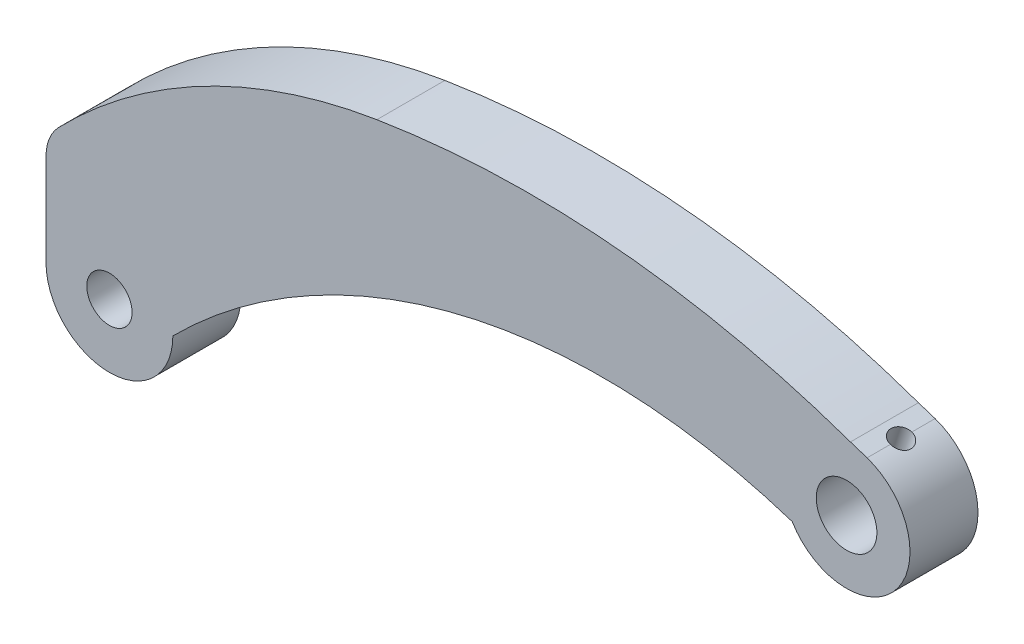
ISO-10303-21;
HEADER;
FILE_DESCRIPTION(('STEP AP214'),'2;1');
FILE_NAME('part.step','',(''),(''),'','','');
FILE_SCHEMA(('AUTOMOTIVE_DESIGN { 1 0 10303 214 1 1 1 1 }'));
ENDSEC;
DATA;
#1=APPLICATION_CONTEXT('core data for automotive mechanical design processes');
#2=APPLICATION_PROTOCOL_DEFINITION('international standard','automotive_design',2000,#1);
#3=PRODUCT_CONTEXT('',#1,'mechanical');
#4=PRODUCT('Part','Part','',(#3));
#5=PRODUCT_RELATED_PRODUCT_CATEGORY('part','',(#4));
#6=PRODUCT_DEFINITION_FORMATION('','',#4);
#7=PRODUCT_DEFINITION_CONTEXT('part definition',#1,'design');
#8=PRODUCT_DEFINITION('design','',#6,#7);
#9=PRODUCT_DEFINITION_SHAPE('','',#8);
#10=(LENGTH_UNIT() NAMED_UNIT(*) SI_UNIT(.MILLI.,.METRE.));
#11=(NAMED_UNIT(*) PLANE_ANGLE_UNIT() SI_UNIT($,.RADIAN.));
#12=(NAMED_UNIT(*) SI_UNIT($,.STERADIAN.) SOLID_ANGLE_UNIT());
#13=UNCERTAINTY_MEASURE_WITH_UNIT(LENGTH_MEASURE(1.E-05),#10,'distance_accuracy_value','');
#14=(GEOMETRIC_REPRESENTATION_CONTEXT(3) GLOBAL_UNCERTAINTY_ASSIGNED_CONTEXT((#13)) GLOBAL_UNIT_ASSIGNED_CONTEXT((#10,
#11,#12)) REPRESENTATION_CONTEXT('',''));
#15=CARTESIAN_POINT('',(0.,0.,0.));
#16=DIRECTION('',(0.,0.,1.));
#17=DIRECTION('',(1.,0.,0.));
#18=AXIS2_PLACEMENT_3D('',#15,#16,#17);
#19=CARTESIAN_POINT('',(23.7460808958069,-140.29031019522,0.));
#20=DIRECTION('',(0.309317373994585,0.950958864591468,0.));
#21=DIRECTION('',(-0.950958864591468,0.309317373994585,0.));
#22=AXIS2_PLACEMENT_3D('',#19,#20,#21);
#23=CYLINDRICAL_SURFACE('',#22,1.5);
#24=CARTESIAN_POINT('',(47.3285287994342,-67.7889256363516,-1.50000000000001));
#25=CARTESIAN_POINT('',(47.3682303350276,-67.8025109764546,-1.50000006487762));
#26=CARTESIAN_POINT('',(47.407815026627,-67.8163742276622,-1.49823853545064));
#27=CARTESIAN_POINT('',(47.4865049498814,-67.8445538739273,-1.4912156476978));
#28=CARTESIAN_POINT('',(47.5256102334144,-67.858870219343,-1.48595467152234));
#29=CARTESIAN_POINT('',(47.6416818857849,-67.9022860648032,-1.46498764472187));
#30=CARTESIAN_POINT('',(47.7175798313425,-67.9319126898596,-1.44409726018458));
#31=CARTESIAN_POINT('',(47.8642977383525,-67.9914094850627,-1.38912726676771));
#32=CARTESIAN_POINT('',(47.9351167127341,-68.0212797013005,-1.35504510232548));
#33=CARTESIAN_POINT('',(48.0699157365782,-68.0800420108765,-1.27468467640612));
#34=CARTESIAN_POINT('',(48.1338958356743,-68.1089341113124,-1.22840650345083));
#35=CARTESIAN_POINT('',(48.2540301234609,-68.1647096546514,-1.1244461105386));
#36=CARTESIAN_POINT('',(48.310104390702,-68.1915714640551,-1.0666599603315));
#37=CARTESIAN_POINT('',(48.4123779747691,-68.2416765290343,-0.941521687238114));
#38=CARTESIAN_POINT('',(48.4585736556197,-68.264918451399,-0.87416605727798));
#39=CARTESIAN_POINT('',(48.5401818677253,-68.3066716751952,-0.731334637767884));
#40=CARTESIAN_POINT('',(48.575531128758,-68.3251551220711,-0.655814553246331));
#41=CARTESIAN_POINT('',(48.6341592037986,-68.3561475225576,-0.499147850276304));
#42=CARTESIAN_POINT('',(48.6574526841618,-68.3686637340875,-0.418008205220719));
#43=CARTESIAN_POINT('',(48.6856927824057,-68.3839164821985,-0.280346828970182));
#44=CARTESIAN_POINT('',(48.6941753103415,-68.3885265207487,-0.224726146877583));
#45=CARTESIAN_POINT('',(48.7055011950289,-68.3946908619929,-0.112744995411297));
#46=CARTESIAN_POINT('',(48.708344532282,-68.3962451541212,-0.0563845234803314));
#47=CARTESIAN_POINT('',(48.7083395704175,-68.3962405159085,0.0834528182910066));
#48=CARTESIAN_POINT('',(48.7021036248019,-68.3928288257399,0.166958323797287));
#49=CARTESIAN_POINT('',(48.6773057895622,-68.3793749135364,0.331627661046964));
#50=CARTESIAN_POINT('',(48.6587310571263,-68.3693257829915,0.412788960883568));
#51=CARTESIAN_POINT('',(48.6097523674377,-68.3431987928795,0.570347921744325));
#52=CARTESIAN_POINT('',(48.579360003667,-68.3271268424538,0.646750166591005));
#53=CARTESIAN_POINT('',(48.5075019414559,-68.2898540707275,0.792775696202058));
#54=CARTESIAN_POINT('',(48.4660374733196,-68.2686538192953,0.862399732971478));
#55=CARTESIAN_POINT('',(48.3725243834121,-68.2219893176989,0.993724360458435));
#56=CARTESIAN_POINT('',(48.3203684642384,-68.1964823438438,1.05533336788289));
#57=CARTESIAN_POINT('',(48.2069835359328,-68.1426365637745,1.16809131398349));
#58=CARTESIAN_POINT('',(48.145753462535,-68.1142974255159,1.21923902402524));
#59=CARTESIAN_POINT('',(48.0151352902676,-68.055856770622,1.31004787790878));
#60=CARTESIAN_POINT('',(47.9456803363228,-68.0257419742562,1.34960431817512));
#61=CARTESIAN_POINT('',(47.8008394471054,-67.9653102564583,1.41543948885238));
#62=CARTESIAN_POINT('',(47.7254571572697,-67.9349934695955,1.44172630767256));
#63=CARTESIAN_POINT('',(47.596159264718,-67.8851401055726,1.47392851591902));
#64=CARTESIAN_POINT('',(47.5432802823712,-67.8653187376171,1.4836940444565));
#65=CARTESIAN_POINT('',(47.4365133395402,-67.8264644383593,1.49673100998773));
#66=CARTESIAN_POINT('',(47.3826266037633,-67.8074306302167,1.50000987049479));
#67=CARTESIAN_POINT('',(47.3285287994342,-67.7889256363516,1.5));
#68=B_SPLINE_CURVE_WITH_KNOTS('',3,(#24,#25,#26,#27,#28,#29,#30,#31,#32,#33,#34,#35,#36,#37,#38,
#39,#40,#41,#42,#43,#44,#45,#46,#47,#48,#49,#50,#51,#52,#53,#54,#55,#56,#57,#58,#59,#60,#61,#62,
#63,#64,#65,#66,#67),.UNSPECIFIED.,.F.,.F.,(4,2,2,2,2,2,2,2,2,2,2,2,2,2,2,2,2,2,2,2,2,4),(0.,
0.125806112671936,0.251598489182454,0.502632917958275,0.75371600245503,1.00479726457451,
1.25825827432157,1.51181241457591,1.76681865881192,2.02151394387584,2.19052675558006,
2.35954015167561,2.60969113926049,2.86010290503284,3.11026962598924,3.36040856061384,
3.61319289420979,3.86600689921312,4.12103874593439,4.37591495141606,4.54748626685377,
4.71886111772352),.UNSPECIFIED.);
#69=CARTESIAN_POINT('',(47.3285287994342,-67.7889256363516,-1.50000000000001));
#70=VERTEX_POINT('',#69);
#71=CARTESIAN_POINT('',(47.3285287994342,-67.7889256363516,1.5));
#72=VERTEX_POINT('',#71);
#73=EDGE_CURVE('E180',#70,#72,#68,.T.);
#74=ORIENTED_EDGE('',*,*,#73,.F.);
#75=CARTESIAN_POINT('',(47.3285287994342,-67.7889256363516,0.));
#76=DIRECTION('',(0.309317373994585,0.950958864591468,0.));
#77=DIRECTION('',(-0.950958864591468,0.309317373994585,0.));
#78=AXIS2_PLACEMENT_3D('',#75,#76,#77);
#79=CIRCLE('',#78,1.5);
#80=EDGE_CURVE('E195',#70,#72,#79,.T.);
#81=ORIENTED_EDGE('',*,*,#80,.T.);
#82=EDGE_LOOP('',(#74,#81));
#83=FACE_BOUND('',#82,.T.);
#84=CARTESIAN_POINT('',(44.3976002168387,-71.9503230401918,0.));
#85=CARTESIAN_POINT('',(44.3976059364193,-71.95032060843,-0.0818651420816196));
#86=CARTESIAN_POINT('',(44.4047150701796,-71.9502168495289,-0.163809287220281));
#87=CARTESIAN_POINT('',(44.43283987386,-71.9500125310232,-0.32535242406495));
#88=CARTESIAN_POINT('',(44.4538777242298,-71.9499119767899,-0.404947463476986));
#89=CARTESIAN_POINT('',(44.5088579364115,-71.9503195399592,-0.559315765857533));
#90=CARTESIAN_POINT('',(44.542768784358,-71.9508261774023,-0.6341002865423));
#91=CARTESIAN_POINT('',(44.6221718074983,-71.9533038562512,-0.77718459908814));
#92=CARTESIAN_POINT('',(44.6676632011694,-71.9552747988544,-0.845484828120138));
#93=CARTESIAN_POINT('',(44.770414449889,-71.9617731841159,-0.976209120917623));
#94=CARTESIAN_POINT('',(44.8280180566089,-71.9663842136279,-1.03835901038345));
#95=CARTESIAN_POINT('',(44.9521699970178,-71.9793110255312,-1.15253809441201));
#96=CARTESIAN_POINT('',(45.0187198214851,-71.9876274259131,-1.20456559865866));
#97=CARTESIAN_POINT('',(45.1601192579471,-72.0091248590779,-1.29796668245568));
#98=CARTESIAN_POINT('',(45.2351041337644,-72.0223965761226,-1.33911555513279));
#99=CARTESIAN_POINT('',(45.3898791457337,-72.0544770463956,-1.40804856316677));
#100=CARTESIAN_POINT('',(45.4696677024725,-72.0732839875081,-1.43583706459888));
#101=CARTESIAN_POINT('',(45.6281350599184,-72.1157675728921,-1.47620871914781));
#102=CARTESIAN_POINT('',(45.7067303520974,-72.1392190515138,-1.48935620779978));
#103=CARTESIAN_POINT('',(45.8633808810556,-72.1910531956163,-1.50194565091002));
#104=CARTESIAN_POINT('',(45.9414362364508,-72.2194347397922,-1.50139071783501));
#105=CARTESIAN_POINT('',(46.0918627301247,-72.2791447704174,-1.48695005525379));
#106=CARTESIAN_POINT('',(46.1643373326083,-72.3103309245278,-1.47354350574007));
#107=CARTESIAN_POINT('',(46.3047335908104,-72.375284281791,-1.43464517782748));
#108=CARTESIAN_POINT('',(46.3726547314223,-72.4090517760341,-1.40915203476713));
#109=CARTESIAN_POINT('',(46.5040155317334,-72.4785520149796,-1.34620644933627));
#110=CARTESIAN_POINT('',(46.5673120509666,-72.5143123104898,-1.30848659878962));
#111=CARTESIAN_POINT('',(46.6864711535024,-72.5853745582881,-1.22237918566442));
#112=CARTESIAN_POINT('',(46.7423315547846,-72.6206763733116,-1.1739885029026));
#113=CARTESIAN_POINT('',(46.8486908497813,-72.6910007385329,-1.064687135295));
#114=CARTESIAN_POINT('',(46.8987070247474,-72.7258942791514,-1.00322265686307));
#115=CARTESIAN_POINT('',(46.9886772165744,-72.791083241501,-0.871099585935352));
#116=CARTESIAN_POINT('',(47.028626009379,-72.8213762727595,-0.80043624879112));
#117=CARTESIAN_POINT('',(47.0981330825732,-72.8755654782016,-0.650633704702185));
#118=CARTESIAN_POINT('',(47.1275483292776,-72.8993726157647,-0.571395554281766));
#119=CARTESIAN_POINT('',(47.1744564875867,-72.937979757231,-0.407497109996783));
#120=CARTESIAN_POINT('',(47.1919771050053,-72.9528006837781,-0.322849922397457));
#121=CARTESIAN_POINT('',(47.2084588768708,-72.9668218407131,-0.197797675730206));
#122=CARTESIAN_POINT('',(47.2123309328916,-72.9701332200679,-0.158418004829951));
#123=CARTESIAN_POINT('',(47.2175001216244,-72.9745613243914,-0.0793656626350794));
#124=CARTESIAN_POINT('',(47.218797229838,-72.9756780284796,-0.0396929885563762));
#125=CARTESIAN_POINT('',(47.2187923616012,-72.9756692780734,0.0806021100294708));
#126=CARTESIAN_POINT('',(47.2134338597944,-72.9710467880678,0.161287986658209));
#127=CARTESIAN_POINT('',(47.1921403759286,-72.9529473210158,0.320311209857229));
#128=CARTESIAN_POINT('',(47.1761873275122,-72.9394552194565,0.398644305440923));
#129=CARTESIAN_POINT('',(47.1341943767376,-72.9048015075929,0.550479416556436));
#130=CARTESIAN_POINT('',(47.108186478963,-72.8836642454548,0.623995903680063));
#131=CARTESIAN_POINT('',(47.0466517780617,-72.8352673597491,0.764721566500378));
#132=CARTESIAN_POINT('',(47.0111253135239,-72.8080079539604,0.831930966434285));
#133=CARTESIAN_POINT('',(46.9292696487013,-72.7476934303814,0.961647357456819));
#134=CARTESIAN_POINT('',(46.8825111492978,-72.7144261091437,1.02378479814772));
#135=CARTESIAN_POINT('',(46.779946121366,-72.6450482895027,1.13825676621373));
#136=CARTESIAN_POINT('',(46.7241369181908,-72.6089369522687,1.19058838590739));
#137=CARTESIAN_POINT('',(46.6018654848755,-72.534306853469,1.28608003414213));
#138=CARTESIAN_POINT('',(46.5350578947081,-72.4957503159395,1.32877071050634));
#139=CARTESIAN_POINT('',(46.3939506548164,-72.4197931162786,1.40069039597706));
#140=CARTESIAN_POINT('',(46.3196530741916,-72.382392138635,1.42992311047256));
#141=CARTESIAN_POINT('',(46.1682371481221,-72.3119571229249,1.47297304946269));
#142=CARTESIAN_POINT('',(46.0913172967648,-72.2788142124438,1.48730841522221));
#143=CARTESIAN_POINT('',(45.9344879621997,-72.2167983040378,1.50173133304813));
#144=CARTESIAN_POINT('',(45.854579543768,-72.1879238031712,1.50182391210994));
#145=CARTESIAN_POINT('',(45.6984844355325,-72.1367267028955,1.48805698553485));
#146=CARTESIAN_POINT('',(45.622318637322,-72.1141427699445,1.47491769008969));
#147=CARTESIAN_POINT('',(45.4718699308668,-72.0739429265517,1.43619844224358));
#148=CARTESIAN_POINT('',(45.3975870787741,-72.0563271641095,1.41061811929202));
#149=CARTESIAN_POINT('',(45.2527876464924,-72.0258492949518,1.34771725832351));
#150=CARTESIAN_POINT('',(45.1822871977569,-72.0130063475389,1.3103504920729));
#151=CARTESIAN_POINT('',(45.0473297877633,-71.9916307254425,1.22498881144666));
#152=CARTESIAN_POINT('',(44.9828741213594,-71.9830989725512,1.17699162729517));
#153=CARTESIAN_POINT('',(44.8588923426785,-71.9692336200986,1.06907232273031));
#154=CARTESIAN_POINT('',(44.7997451794869,-71.964070953022,1.00869248348592));
#155=CARTESIAN_POINT('',(44.6918313831941,-71.9565400840731,0.879069169113059));
#156=CARTESIAN_POINT('',(44.6430700855593,-71.9541733156959,0.809821167306805));
#157=CARTESIAN_POINT('',(44.5566804326529,-71.9511135727337,0.662513982636291));
#158=CARTESIAN_POINT('',(44.5193308366293,-71.9504599349689,0.584290080552327));
#159=CARTESIAN_POINT('',(44.4589524196357,-71.9499005624813,0.42259320053794));
#160=CARTESIAN_POINT('',(44.4358955177589,-71.9499933561936,0.339130872327903));
#161=CARTESIAN_POINT('',(44.4129057933538,-71.9501561675877,0.212413382454601));
#162=CARTESIAN_POINT('',(44.4071754082408,-71.95021401768,0.170141545459763));
#163=CARTESIAN_POINT('',(44.3995211317564,-71.9502980872346,0.0852536156205944));
#164=CARTESIAN_POINT('',(44.3975972379304,-71.9503243067174,0.0426375229982817));
#165=CARTESIAN_POINT('',(44.3976002168387,-71.9503230401918,0.));
#166=B_SPLINE_CURVE_WITH_KNOTS('',3,(#84,#85,#86,#87,#88,#89,#90,#91,#92,#93,#94,#95,#96,#97,
#98,#99,#100,#101,#102,#103,#104,#105,#106,#107,#108,#109,#110,#111,#112,#113,#114,#115,#116,
#117,#118,#119,#120,#121,#122,#123,#124,#125,#126,#127,#128,#129,#130,#131,#132,#133,#134,#135,
#136,#137,#138,#139,#140,#141,#142,#143,#144,#145,#146,#147,#148,#149,#150,#151,#152,#153,#154,
#155,#156,#157,#158,#159,#160,#161,#162,#163,#164,#165),.UNSPECIFIED.,.T.,.F.,(4,2,2,2,2,2,2,2,
2,2,2,2,2,2,2,2,2,2,2,2,2,2,2,2,2,2,2,2,2,2,2,2,2,2,2,2,2,2,2,2,4),(0.,0.245430915575825,
0.491253604767287,0.736478346155514,0.981686542733957,1.23512499173532,1.48860572564103,
1.74697275968677,2.005255303719,2.25319494199923,2.50107826200312,2.74006462503222,
2.9790779777322,3.22371798969747,3.46842963021246,3.72699834197821,3.98570095239956,
4.24779397754201,4.50927440299091,4.62827513155107,4.74727699230264,4.98892675017831,
5.23098964319734,5.47228831069837,5.71357839600348,5.96621068335553,6.2189177646243,
6.48208605827128,6.74518185023057,6.99878505602734,7.25229875229871,7.49272152100294,
7.73315145103347,7.974536361966,8.21597286247344,8.46886376863702,8.72188427919299,
8.98066570181906,9.23893707070948,9.36676404064512,9.49459092814897),.UNSPECIFIED.);
#167=CARTESIAN_POINT('',(44.3976002168387,-71.9503230401918,0.));
#168=VERTEX_POINT('',#167);
#169=EDGE_CURVE('E141',#168,#168,#166,.T.);
#170=ORIENTED_EDGE('',*,*,#169,.T.);
#171=EDGE_LOOP('',(#170));
#172=FACE_BOUND('',#171,.T.);
#173=ADVANCED_FACE('F17',(#83,#172),#23,.F.);
#174=CARTESIAN_POINT('',(-30.6719542333047,-74.7945228686604,4.765));
#175=DIRECTION('',(0.,0.,1.));
#176=DIRECTION('',(1.,0.,0.));
#177=AXIS2_PLACEMENT_3D('',#174,#175,#176);
#178=PLANE('',#177);
#179=CARTESIAN_POINT('',(-58.8642459320123,-101.636771367044,4.765));
#180=DIRECTION('',(0.,0.,1.));
#181=DIRECTION('',(1.,0.,0.));
#182=AXIS2_PLACEMENT_3D('',#179,#180,#181);
#183=CIRCLE('',#182,3.175);
#184=CARTESIAN_POINT('',(-55.6892459320123,-101.636771367044,4.765));
#185=VERTEX_POINT('',#184);
#186=EDGE_CURVE('E138',#185,#185,#183,.F.);
#187=ORIENTED_EDGE('',*,*,#186,.T.);
#188=EDGE_LOOP('',(#187));
#189=FACE_BOUND('',#188,.T.);
#190=CARTESIAN_POINT('',(44.45,-76.2,4.765));
#191=DIRECTION('',(0.,0.,-1.));
#192=DIRECTION('',(-1.,0.,0.));
#193=AXIS2_PLACEMENT_3D('',#190,#191,#192);
#194=CIRCLE('',#193,4.25);
#195=CARTESIAN_POINT('',(40.2,-76.2,4.765));
#196=VERTEX_POINT('',#195);
#197=EDGE_CURVE('E147',#196,#196,#194,.T.);
#198=ORIENTED_EDGE('',*,*,#197,.T.);
#199=EDGE_LOOP('',(#198));
#200=FACE_BOUND('',#199,.T.);
#201=CARTESIAN_POINT('',(44.45,-76.2,4.765));
#202=DIRECTION('',(0.,0.,-1.));
#203=DIRECTION('',(-1.,0.,0.));
#204=AXIS2_PLACEMENT_3D('',#201,#202,#203);
#205=CIRCLE('',#204,8.88999999999971);
#206=CARTESIAN_POINT('',(47.3285287994341,-67.7889256363515,4.765));
#207=VERTEX_POINT('',#206);
#208=CARTESIAN_POINT('',(36.8272711246995,-80.7745059289123,4.765));
#209=VERTEX_POINT('',#208);
#210=EDGE_CURVE('E185',#207,#209,#205,.T.);
#211=ORIENTED_EDGE('',*,*,#210,.F.);
#212=DIRECTION('',(0.950958864591468,-0.309317373994585,0.));
#213=VECTOR('',#212,1.);
#214=CARTESIAN_POINT('',(44.9932064719902,-67.0293178376839,4.765));
#215=LINE('',#214,#213);
#216=CARTESIAN_POINT('',(44.9932064719887,-67.0293178376834,4.765));
#217=VERTEX_POINT('',#216);
#218=EDGE_CURVE('E114',#207,#217,#215,.F.);
#219=ORIENTED_EDGE('',*,*,#218,.T.);
#220=CARTESIAN_POINT('',(0.17692277358146,-194.169924484433,4.765));
#221=DIRECTION('',(0.,0.,1.));
#222=DIRECTION('',(1.,0.,0.));
#223=AXIS2_PLACEMENT_3D('',#220,#221,#222);
#224=CIRCLE('',#223,134.808134558118);
#225=CARTESIAN_POINT('',(-21.3796446761808,-61.096457772156,4.765));
#226=VERTEX_POINT('',#225);
#227=EDGE_CURVE('E198',#226,#217,#224,.F.);
#228=ORIENTED_EDGE('',*,*,#227,.F.);
#229=CARTESIAN_POINT('',(-8.58720153739144,-140.067043426188,4.765));
#230=DIRECTION('',(0.,0.,-1.));
#231=DIRECTION('',(-1.,0.,0.));
#232=AXIS2_PLACEMENT_3D('',#229,#230,#231);
#233=CIRCLE('',#232,80.);
#234=CARTESIAN_POINT('',(-66.0900473799743,-84.4484968791582,4.765));
#235=VERTEX_POINT('',#234);
#236=EDGE_CURVE('E201',#235,#226,#233,.T.);
#237=ORIENTED_EDGE('',*,*,#236,.F.);
#238=CARTESIAN_POINT('',(-61.4042459320134,-88.734026576907,4.765));
#239=DIRECTION('',(0.,0.,-1.));
#240=DIRECTION('',(-1.,0.,0.));
#241=AXIS2_PLACEMENT_3D('',#238,#239,#240);
#242=CIRCLE('',#241,6.34999999999999);
#243=CARTESIAN_POINT('',(-67.7542459320133,-88.734026576907,4.765));
#244=VERTEX_POINT('',#243);
#245=EDGE_CURVE('E100',#244,#235,#242,.T.);
#246=ORIENTED_EDGE('',*,*,#245,.F.);
#247=DIRECTION('',(0.,1.,0.));
#248=VECTOR('',#247,1.);
#249=CARTESIAN_POINT('',(-67.7542459320134,-101.636771367044,4.765));
#250=LINE('',#249,#248);
#251=CARTESIAN_POINT('',(-67.7542459320131,-101.636771367044,4.765));
#252=VERTEX_POINT('',#251);
#253=EDGE_CURVE('E95',#244,#252,#250,.F.);
#254=ORIENTED_EDGE('',*,*,#253,.T.);
#255=CARTESIAN_POINT('',(-58.8642459320123,-101.636771367044,4.765));
#256=DIRECTION('',(0.,0.,-1.));
#257=DIRECTION('',(-1.,0.,0.));
#258=AXIS2_PLACEMENT_3D('',#255,#256,#257);
#259=CIRCLE('',#258,8.89000000000045);
#260=CARTESIAN_POINT('',(-49.9742459320119,-101.636771367044,4.765));
#261=VERTEX_POINT('',#260);
#262=EDGE_CURVE('E21',#261,#252,#259,.T.);
#263=ORIENTED_EDGE('',*,*,#262,.F.);
#264=CARTESIAN_POINT('',(10.3433224116952,-161.59131944027,4.76500000000001));
#265=DIRECTION('',(0.,0.,1.));
#266=DIRECTION('',(1.,0.,0.));
#267=AXIS2_PLACEMENT_3D('',#264,#265,#266);
#268=CIRCLE('',#267,85.0456164982216);
#269=EDGE_CURVE('E110',#261,#209,#268,.F.);
#270=ORIENTED_EDGE('',*,*,#269,.T.);
#271=EDGE_LOOP('',(#211,#219,#228,#237,#246,#254,#263,#270));
#272=FACE_BOUND('',#271,.T.);
#273=ADVANCED_FACE('F98',(#189,#200,#272),#178,.T.);
#274=CARTESIAN_POINT('',(-67.7542459320134,-101.636771367044,4.765));
#275=DIRECTION('',(1.,0.,0.));
#276=DIRECTION('',(0.,1.,0.));
#277=AXIS2_PLACEMENT_3D('',#274,#275,#276);
#278=PLANE('',#277);
#279=DIRECTION('',(0.,0.,-1.));
#280=VECTOR('',#279,1.);
#281=CARTESIAN_POINT('',(-67.7542459320128,-101.636771367044,4.765));
#282=LINE('',#281,#280);
#283=CARTESIAN_POINT('',(-67.7542459320131,-101.636771367044,-4.765));
#284=VERTEX_POINT('',#283);
#285=EDGE_CURVE('E92',#252,#284,#282,.T.);
#286=ORIENTED_EDGE('',*,*,#285,.F.);
#287=ORIENTED_EDGE('',*,*,#253,.F.);
#288=DIRECTION('',(0.,0.,-1.));
#289=VECTOR('',#288,1.);
#290=CARTESIAN_POINT('',(-67.7542459320134,-88.734026576907,4.765));
#291=LINE('',#290,#289);
#292=CARTESIAN_POINT('',(-67.7542459320134,-88.734026576907,-4.765));
#293=VERTEX_POINT('',#292);
#294=EDGE_CURVE('E204',#293,#244,#291,.F.);
#295=ORIENTED_EDGE('',*,*,#294,.F.);
#296=DIRECTION('',(0.,1.,0.));
#297=VECTOR('',#296,1.);
#298=CARTESIAN_POINT('',(-67.7542459320134,-74.7945228686604,-4.765));
#299=LINE('',#298,#297);
#300=EDGE_CURVE('E108',#293,#284,#299,.F.);
#301=ORIENTED_EDGE('',*,*,#300,.T.);
#302=EDGE_LOOP('',(#286,#287,#295,#301));
#303=FACE_BOUND('',#302,.T.);
#304=ADVANCED_FACE('F106',(#303),#278,.F.);
#305=CARTESIAN_POINT('',(-58.8642459320123,-101.636771367044,4.765));
#306=DIRECTION('',(0.,0.,-1.));
#307=DIRECTION('',(-1.,0.,0.));
#308=AXIS2_PLACEMENT_3D('',#305,#306,#307);
#309=CYLINDRICAL_SURFACE('',#308,8.89000000000045);
#310=ORIENTED_EDGE('',*,*,#262,.T.);
#311=ORIENTED_EDGE('',*,*,#285,.T.);
#312=CARTESIAN_POINT('',(-58.8642459320123,-101.636771367044,-4.765));
#313=DIRECTION('',(0.,0.,-1.));
#314=DIRECTION('',(-1.,0.,0.));
#315=AXIS2_PLACEMENT_3D('',#312,#313,#314);
#316=CIRCLE('',#315,8.89000000000045);
#317=CARTESIAN_POINT('',(-49.9742459320119,-101.636771367044,-4.765));
#318=VERTEX_POINT('',#317);
#319=EDGE_CURVE('E136',#284,#318,#316,.F.);
#320=ORIENTED_EDGE('',*,*,#319,.T.);
#321=DIRECTION('',(0.,0.,1.));
#322=VECTOR('',#321,1.);
#323=CARTESIAN_POINT('',(-49.9742459320119,-101.636771367044,-97.6963118584092));
#324=LINE('',#323,#322);
#325=EDGE_CURVE('E94',#318,#261,#324,.T.);
#326=ORIENTED_EDGE('',*,*,#325,.T.);
#327=EDGE_LOOP('',(#310,#311,#320,#326));
#328=FACE_BOUND('',#327,.T.);
#329=ADVANCED_FACE('F89',(#328),#309,.T.);
#330=CARTESIAN_POINT('',(10.3433224116952,-161.59131944027,-97.6963118584092));
#331=DIRECTION('',(0.,0.,1.));
#332=DIRECTION('',(1.,0.,0.));
#333=AXIS2_PLACEMENT_3D('',#330,#331,#332);
#334=CYLINDRICAL_SURFACE('',#333,85.0456164982216);
#335=DIRECTION('',(0.,0.,-1.));
#336=VECTOR('',#335,1.);
#337=CARTESIAN_POINT('',(36.8272711246993,-80.774505928912,4.765));
#338=LINE('',#337,#336);
#339=CARTESIAN_POINT('',(36.8272711246995,-80.7745059289123,-4.765));
#340=VERTEX_POINT('',#339);
#341=EDGE_CURVE('E117',#209,#340,#338,.T.);
#342=ORIENTED_EDGE('',*,*,#341,.F.);
#343=ORIENTED_EDGE('',*,*,#269,.F.);
#344=ORIENTED_EDGE('',*,*,#325,.F.);
#345=CARTESIAN_POINT('',(10.3433224116952,-161.59131944027,-4.76500000000001));
#346=DIRECTION('',(0.,0.,1.));
#347=DIRECTION('',(1.,0.,0.));
#348=AXIS2_PLACEMENT_3D('',#345,#346,#347);
#349=CIRCLE('',#348,85.0456164982216);
#350=EDGE_CURVE('E133',#318,#340,#349,.F.);
#351=ORIENTED_EDGE('',*,*,#350,.T.);
#352=EDGE_LOOP('',(#342,#343,#344,#351));
#353=FACE_BOUND('',#352,.T.);
#354=ADVANCED_FACE('F176',(#353),#334,.F.);
#355=CARTESIAN_POINT('',(44.45,-76.2,4.765));
#356=DIRECTION('',(0.,0.,-1.));
#357=DIRECTION('',(-1.,0.,0.));
#358=AXIS2_PLACEMENT_3D('',#355,#356,#357);
#359=CYLINDRICAL_SURFACE('',#358,8.88999999999971);
#360=ORIENTED_EDGE('',*,*,#341,.T.);
#361=CARTESIAN_POINT('',(44.45,-76.2,-4.765));
#362=DIRECTION('',(0.,0.,-1.));
#363=DIRECTION('',(-1.,0.,0.));
#364=AXIS2_PLACEMENT_3D('',#361,#362,#363);
#365=CIRCLE('',#364,8.88999999999971);
#366=CARTESIAN_POINT('',(47.3285287994341,-67.7889256363515,-4.765));
#367=VERTEX_POINT('',#366);
#368=EDGE_CURVE('E130',#340,#367,#365,.F.);
#369=ORIENTED_EDGE('',*,*,#368,.T.);
#370=DIRECTION('',(0.,0.,1.));
#371=VECTOR('',#370,1.);
#372=CARTESIAN_POINT('',(47.3285287994342,-67.7889256363516,-4.765));
#373=LINE('',#372,#371);
#374=EDGE_CURVE('E116',#367,#70,#373,.T.);
#375=ORIENTED_EDGE('',*,*,#374,.T.);
#376=ORIENTED_EDGE('',*,*,#73,.T.);
#377=DIRECTION('',(0.,0.,1.));
#378=VECTOR('',#377,1.);
#379=CARTESIAN_POINT('',(47.3285287994342,-67.7889256363516,-4.765));
#380=LINE('',#379,#378);
#381=EDGE_CURVE('E196',#72,#207,#380,.T.);
#382=ORIENTED_EDGE('',*,*,#381,.T.);
#383=ORIENTED_EDGE('',*,*,#210,.T.);
#384=EDGE_LOOP('',(#360,#369,#375,#376,#382,#383));
#385=FACE_BOUND('',#384,.T.);
#386=ADVANCED_FACE('F171',(#385),#359,.T.);
#387=CARTESIAN_POINT('',(44.9932064719902,-67.0293178376839,-4.765));
#388=DIRECTION('',(-0.309317373994585,-0.950958864591468,0.));
#389=DIRECTION('',(0.950958864591468,-0.309317373994585,0.));
#390=AXIS2_PLACEMENT_3D('',#387,#388,#389);
#391=PLANE('',#390);
#392=ORIENTED_EDGE('',*,*,#80,.F.);
#393=ORIENTED_EDGE('',*,*,#374,.F.);
#394=DIRECTION('',(-0.950958864591468,0.309317373994587,0.));
#395=VECTOR('',#394,1.);
#396=CARTESIAN_POINT('',(47.3285287994342,-67.7889256363516,-4.765));
#397=LINE('',#396,#395);
#398=CARTESIAN_POINT('',(44.9932064719883,-67.0293178376833,-4.765));
#399=VERTEX_POINT('',#398);
#400=EDGE_CURVE('E129',#367,#399,#397,.T.);
#401=ORIENTED_EDGE('',*,*,#400,.T.);
#402=DIRECTION('',(0.,0.,1.));
#403=VECTOR('',#402,1.);
#404=CARTESIAN_POINT('',(44.9932064719902,-67.0293178376839,-4.765));
#405=LINE('',#404,#403);
#406=EDGE_CURVE('E199',#217,#399,#405,.F.);
#407=ORIENTED_EDGE('',*,*,#406,.F.);
#408=ORIENTED_EDGE('',*,*,#218,.F.);
#409=ORIENTED_EDGE('',*,*,#381,.F.);
#410=EDGE_LOOP('',(#392,#393,#401,#407,#408,#409));
#411=FACE_BOUND('',#410,.T.);
#412=ADVANCED_FACE('F167',(#411),#391,.F.);
#413=CARTESIAN_POINT('',(0.17692277358146,-194.169924484433,-4.765));
#414=DIRECTION('',(0.,0.,1.));
#415=DIRECTION('',(1.,0.,0.));
#416=AXIS2_PLACEMENT_3D('',#413,#414,#415);
#417=CYLINDRICAL_SURFACE('',#416,134.808134558118);
#418=ORIENTED_EDGE('',*,*,#227,.T.);
#419=ORIENTED_EDGE('',*,*,#406,.T.);
#420=CARTESIAN_POINT('',(0.17692277358146,-194.169924484433,-4.765));
#421=DIRECTION('',(0.,0.,1.));
#422=DIRECTION('',(1.,0.,0.));
#423=AXIS2_PLACEMENT_3D('',#420,#421,#422);
#424=CIRCLE('',#423,134.808134558118);
#425=CARTESIAN_POINT('',(-21.3796446761808,-61.096457772156,-4.76499999999999));
#426=VERTEX_POINT('',#425);
#427=EDGE_CURVE('E126',#399,#426,#424,.T.);
#428=ORIENTED_EDGE('',*,*,#427,.T.);
#429=DIRECTION('',(0.,0.,-1.));
#430=VECTOR('',#429,1.);
#431=CARTESIAN_POINT('',(-21.3796446761808,-61.096457772156,4.765));
#432=LINE('',#431,#430);
#433=EDGE_CURVE('E202',#226,#426,#432,.T.);
#434=ORIENTED_EDGE('',*,*,#433,.F.);
#435=EDGE_LOOP('',(#418,#419,#428,#434));
#436=FACE_BOUND('',#435,.T.);
#437=ADVANCED_FACE('F163',(#436),#417,.T.);
#438=CARTESIAN_POINT('',(-8.58720153739144,-140.067043426188,4.765));
#439=DIRECTION('',(0.,0.,-1.));
#440=DIRECTION('',(-1.,0.,0.));
#441=AXIS2_PLACEMENT_3D('',#438,#439,#440);
#442=CYLINDRICAL_SURFACE('',#441,80.);
#443=ORIENTED_EDGE('',*,*,#236,.T.);
#444=ORIENTED_EDGE('',*,*,#433,.T.);
#445=CARTESIAN_POINT('',(-8.58720153739144,-140.067043426188,-4.76499999999999));
#446=DIRECTION('',(0.,0.,-1.));
#447=DIRECTION('',(-1.,0.,0.));
#448=AXIS2_PLACEMENT_3D('',#445,#446,#447);
#449=CIRCLE('',#448,80.);
#450=CARTESIAN_POINT('',(-66.0900473799743,-84.4484968791582,-4.765));
#451=VERTEX_POINT('',#450);
#452=EDGE_CURVE('E123',#426,#451,#449,.F.);
#453=ORIENTED_EDGE('',*,*,#452,.T.);
#454=DIRECTION('',(0.,0.,-1.));
#455=VECTOR('',#454,1.);
#456=CARTESIAN_POINT('',(-66.090047379974,-84.4484968791579,4.765));
#457=LINE('',#456,#455);
#458=EDGE_CURVE('E36',#235,#451,#457,.T.);
#459=ORIENTED_EDGE('',*,*,#458,.F.);
#460=EDGE_LOOP('',(#443,#444,#453,#459));
#461=FACE_BOUND('',#460,.T.);
#462=ADVANCED_FACE('F160',(#461),#442,.T.);
#463=CARTESIAN_POINT('',(-61.4042459320134,-88.734026576907,4.765));
#464=DIRECTION('',(0.,0.,-1.));
#465=DIRECTION('',(-1.,0.,0.));
#466=AXIS2_PLACEMENT_3D('',#463,#464,#465);
#467=CYLINDRICAL_SURFACE('',#466,6.34999999999999);
#468=ORIENTED_EDGE('',*,*,#245,.T.);
#469=ORIENTED_EDGE('',*,*,#458,.T.);
#470=CARTESIAN_POINT('',(-61.4042459320134,-88.734026576907,-4.765));
#471=DIRECTION('',(0.,0.,-1.));
#472=DIRECTION('',(-1.,0.,0.));
#473=AXIS2_PLACEMENT_3D('',#470,#471,#472);
#474=CIRCLE('',#473,6.34999999999999);
#475=EDGE_CURVE('E121',#451,#293,#474,.F.);
#476=ORIENTED_EDGE('',*,*,#475,.T.);
#477=ORIENTED_EDGE('',*,*,#294,.T.);
#478=EDGE_LOOP('',(#468,#469,#476,#477));
#479=FACE_BOUND('',#478,.T.);
#480=ADVANCED_FACE('F155',(#479),#467,.T.);
#481=CARTESIAN_POINT('',(44.45,-76.2,5.235));
#482=DIRECTION('',(0.,0.,-1.));
#483=DIRECTION('',(-1.,0.,0.));
#484=AXIS2_PLACEMENT_3D('',#481,#482,#483);
#485=CYLINDRICAL_SURFACE('',#484,4.25);
#486=ORIENTED_EDGE('',*,*,#197,.F.);
#487=EDGE_LOOP('',(#486));
#488=FACE_BOUND('',#487,.T.);
#489=ORIENTED_EDGE('',*,*,#169,.F.);
#490=EDGE_LOOP('',(#489));
#491=FACE_BOUND('',#490,.T.);
#492=CARTESIAN_POINT('',(44.45,-76.2,-4.765));
#493=DIRECTION('',(0.,0.,-1.));
#494=DIRECTION('',(-1.,0.,0.));
#495=AXIS2_PLACEMENT_3D('',#492,#493,#494);
#496=CIRCLE('',#495,4.25);
#497=CARTESIAN_POINT('',(40.2,-76.2,-4.765));
#498=VERTEX_POINT('',#497);
#499=EDGE_CURVE('E27',#498,#498,#496,.T.);
#500=ORIENTED_EDGE('',*,*,#499,.T.);
#501=EDGE_LOOP('',(#500));
#502=FACE_BOUND('',#501,.T.);
#503=ADVANCED_FACE('F149',(#488,#491,#502),#485,.F.);
#504=CARTESIAN_POINT('',(-58.8642459320123,-101.636771367044,-16.0221399564899));
#505=DIRECTION('',(0.,0.,1.));
#506=DIRECTION('',(1.,0.,0.));
#507=AXIS2_PLACEMENT_3D('',#504,#505,#506);
#508=CYLINDRICAL_SURFACE('',#507,3.175);
#509=ORIENTED_EDGE('',*,*,#186,.F.);
#510=EDGE_LOOP('',(#509));
#511=FACE_BOUND('',#510,.T.);
#512=CARTESIAN_POINT('',(-58.8642459320123,-101.636771367044,-4.765));
#513=DIRECTION('',(0.,0.,1.));
#514=DIRECTION('',(1.,0.,0.));
#515=AXIS2_PLACEMENT_3D('',#512,#513,#514);
#516=CIRCLE('',#515,3.175);
#517=CARTESIAN_POINT('',(-55.6892459320123,-101.636771367044,-4.765));
#518=VERTEX_POINT('',#517);
#519=EDGE_CURVE('E11',#518,#518,#516,.F.);
#520=ORIENTED_EDGE('',*,*,#519,.T.);
#521=EDGE_LOOP('',(#520));
#522=FACE_BOUND('',#521,.T.);
#523=ADVANCED_FACE('F154',(#511,#522),#508,.F.);
#524=CARTESIAN_POINT('',(-30.6719542333047,-74.7945228686604,-4.765));
#525=DIRECTION('',(0.,0.,1.));
#526=DIRECTION('',(1.,0.,0.));
#527=AXIS2_PLACEMENT_3D('',#524,#525,#526);
#528=PLANE('',#527);
#529=ORIENTED_EDGE('',*,*,#519,.F.);
#530=EDGE_LOOP('',(#529));
#531=FACE_BOUND('',#530,.T.);
#532=ORIENTED_EDGE('',*,*,#499,.F.);
#533=EDGE_LOOP('',(#532));
#534=FACE_BOUND('',#533,.T.);
#535=ORIENTED_EDGE('',*,*,#452,.F.);
#536=ORIENTED_EDGE('',*,*,#427,.F.);
#537=ORIENTED_EDGE('',*,*,#400,.F.);
#538=ORIENTED_EDGE('',*,*,#368,.F.);
#539=ORIENTED_EDGE('',*,*,#350,.F.);
#540=ORIENTED_EDGE('',*,*,#319,.F.);
#541=ORIENTED_EDGE('',*,*,#300,.F.);
#542=ORIENTED_EDGE('',*,*,#475,.F.);
#543=EDGE_LOOP('',(#535,#536,#537,#538,#539,#540,#541,#542));
#544=FACE_BOUND('',#543,.T.);
#545=ADVANCED_FACE('F215',(#531,#534,#544),#528,.F.);
#546=CLOSED_SHELL('',(#173,#273,#304,#329,#354,#386,#412,#437,#462,#480,#503,#523,#545));
#547=MANIFOLD_SOLID_BREP('B1',#546);
#548=ADVANCED_BREP_SHAPE_REPRESENTATION('',(#18,#547),#14);
#549=SHAPE_DEFINITION_REPRESENTATION(#9,#548);
ENDSEC;
END-ISO-10303-21;
